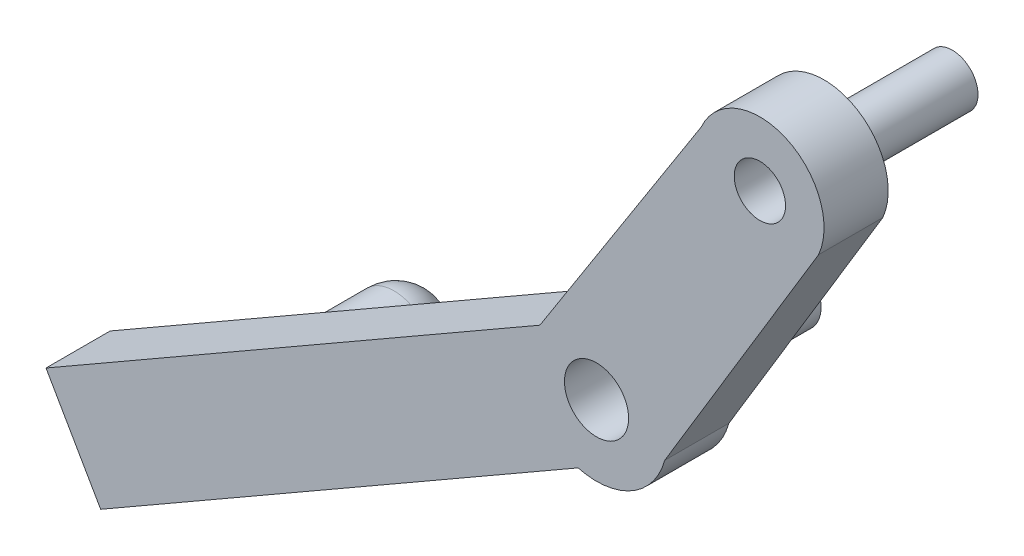
ISO-10303-21;
HEADER;
FILE_DESCRIPTION(('STEP AP214'),'2;1');
FILE_NAME('part.step','',(''),(''),'','','');
FILE_SCHEMA(('AUTOMOTIVE_DESIGN { 1 0 10303 214 1 1 1 1 }'));
ENDSEC;
DATA;
#1=APPLICATION_CONTEXT('core data for automotive mechanical design processes');
#2=APPLICATION_PROTOCOL_DEFINITION('international standard','automotive_design',2000,#1);
#3=PRODUCT_CONTEXT('',#1,'mechanical');
#4=PRODUCT('Part','Part','',(#3));
#5=PRODUCT_RELATED_PRODUCT_CATEGORY('part','',(#4));
#6=PRODUCT_DEFINITION_FORMATION('','',#4);
#7=PRODUCT_DEFINITION_CONTEXT('part definition',#1,'design');
#8=PRODUCT_DEFINITION('design','',#6,#7);
#9=PRODUCT_DEFINITION_SHAPE('','',#8);
#10=(LENGTH_UNIT() NAMED_UNIT(*) SI_UNIT(.MILLI.,.METRE.));
#11=(NAMED_UNIT(*) PLANE_ANGLE_UNIT() SI_UNIT($,.RADIAN.));
#12=(NAMED_UNIT(*) SI_UNIT($,.STERADIAN.) SOLID_ANGLE_UNIT());
#13=UNCERTAINTY_MEASURE_WITH_UNIT(LENGTH_MEASURE(1.E-05),#10,'distance_accuracy_value','');
#14=(GEOMETRIC_REPRESENTATION_CONTEXT(3) GLOBAL_UNCERTAINTY_ASSIGNED_CONTEXT((#13)) GLOBAL_UNIT_ASSIGNED_CONTEXT((#10,
#11,#12)) REPRESENTATION_CONTEXT('',''));
#15=CARTESIAN_POINT('',(0.,0.,0.));
#16=DIRECTION('',(0.,0.,1.));
#17=DIRECTION('',(1.,0.,0.));
#18=AXIS2_PLACEMENT_3D('',#15,#16,#17);
#19=CARTESIAN_POINT('',(2.48034743292827,-4.35301832543163,-15.));
#20=DIRECTION('',(0.,0.,1.));
#21=DIRECTION('',(-1.,0.,0.));
#22=AXIS2_PLACEMENT_3D('',#19,#20,#21);
#23=CYLINDRICAL_SURFACE('',#22,2.5);
#24=CARTESIAN_POINT('',(2.48034743292827,-4.35301832543163,-15.));
#25=DIRECTION('',(0.,0.,1.));
#26=DIRECTION('',(1.,0.,0.));
#27=AXIS2_PLACEMENT_3D('',#24,#25,#26);
#28=CIRCLE('',#27,2.5);
#29=CARTESIAN_POINT('',(4.98034743292827,-4.35301832543163,-15.));
#30=VERTEX_POINT('',#29);
#31=EDGE_CURVE('E11',#30,#30,#28,.T.);
#32=ORIENTED_EDGE('',*,*,#31,.T.);
#33=EDGE_LOOP('',(#32));
#34=FACE_BOUND('',#33,.T.);
#35=CARTESIAN_POINT('',(2.48034743292827,-4.35301832543163,-5.));
#36=DIRECTION('',(0.,0.,1.));
#37=DIRECTION('',(1.,0.,0.));
#38=AXIS2_PLACEMENT_3D('',#35,#36,#37);
#39=CIRCLE('',#38,2.5);
#40=CARTESIAN_POINT('',(4.98034743292827,-4.35301832543163,-5.));
#41=VERTEX_POINT('',#40);
#42=EDGE_CURVE('E49',#41,#41,#39,.T.);
#43=ORIENTED_EDGE('',*,*,#42,.F.);
#44=EDGE_LOOP('',(#43));
#45=FACE_BOUND('',#44,.T.);
#46=ADVANCED_FACE('F46',(#34,#45),#23,.T.);
#47=CARTESIAN_POINT('',(2.48034743292827,-4.35301832543163,-15.));
#48=DIRECTION('',(0.,0.,-1.));
#49=DIRECTION('',(1.,0.,0.));
#50=AXIS2_PLACEMENT_3D('',#47,#48,#49);
#51=PLANE('',#50);
#52=ORIENTED_EDGE('',*,*,#31,.F.);
#53=EDGE_LOOP('',(#52));
#54=FACE_BOUND('',#53,.T.);
#55=ADVANCED_FACE('F61',(#54),#51,.T.);
#56=CARTESIAN_POINT('',(2.48034743292827,-4.35301832543163,-5.));
#57=DIRECTION('',(0.,0.,-1.));
#58=DIRECTION('',(1.,0.,0.));
#59=AXIS2_PLACEMENT_3D('',#56,#57,#58);
#60=PLANE('',#59);
#61=ORIENTED_EDGE('',*,*,#42,.T.);
#62=EDGE_LOOP('',(#61));
#63=FACE_BOUND('',#62,.T.);
#64=ADVANCED_FACE('F58',(#63),#60,.F.);
#65=CLOSED_SHELL('',(#46,#55,#64));
#66=MANIFOLD_SOLID_BREP('B2',#65);
#67=CARTESIAN_POINT('',(15.2131519884464,16.1187767320402,-15.));
#68=DIRECTION('',(0.,0.,1.));
#69=DIRECTION('',(-1.,0.,0.));
#70=AXIS2_PLACEMENT_3D('',#67,#68,#69);
#71=CYLINDRICAL_SURFACE('',#70,2.);
#72=CARTESIAN_POINT('',(15.2131519884464,16.1187767320402,-15.));
#73=DIRECTION('',(0.,0.,1.));
#74=DIRECTION('',(1.,0.,0.));
#75=AXIS2_PLACEMENT_3D('',#72,#73,#74);
#76=CIRCLE('',#75,2.);
#77=CARTESIAN_POINT('',(17.2131519884464,16.1187767320402,-15.));
#78=VERTEX_POINT('',#77);
#79=EDGE_CURVE('E45',#78,#78,#76,.T.);
#80=ORIENTED_EDGE('',*,*,#79,.T.);
#81=EDGE_LOOP('',(#80));
#82=FACE_BOUND('',#81,.T.);
#83=CARTESIAN_POINT('',(15.2131519884464,16.1187767320402,-5.));
#84=DIRECTION('',(0.,0.,1.));
#85=DIRECTION('',(1.,0.,0.));
#86=AXIS2_PLACEMENT_3D('',#83,#84,#85);
#87=CIRCLE('',#86,2.);
#88=CARTESIAN_POINT('',(17.2131519884464,16.1187767320402,-5.));
#89=VERTEX_POINT('',#88);
#90=EDGE_CURVE('E99',#89,#89,#87,.T.);
#91=ORIENTED_EDGE('',*,*,#90,.F.);
#92=EDGE_LOOP('',(#91));
#93=FACE_BOUND('',#92,.T.);
#94=ADVANCED_FACE('F96',(#82,#93),#71,.T.);
#95=CARTESIAN_POINT('',(15.2131519884464,16.1187767320402,-15.));
#96=DIRECTION('',(0.,0.,-1.));
#97=DIRECTION('',(1.,0.,0.));
#98=AXIS2_PLACEMENT_3D('',#95,#96,#97);
#99=PLANE('',#98);
#100=ORIENTED_EDGE('',*,*,#79,.F.);
#101=EDGE_LOOP('',(#100));
#102=FACE_BOUND('',#101,.T.);
#103=ADVANCED_FACE('F111',(#102),#99,.T.);
#104=CARTESIAN_POINT('',(15.2131519884464,16.1187767320402,-5.));
#105=DIRECTION('',(0.,0.,-1.));
#106=DIRECTION('',(1.,0.,0.));
#107=AXIS2_PLACEMENT_3D('',#104,#105,#106);
#108=PLANE('',#107);
#109=ORIENTED_EDGE('',*,*,#90,.T.);
#110=EDGE_LOOP('',(#109));
#111=FACE_BOUND('',#110,.T.);
#112=ADVANCED_FACE('F108',(#111),#108,.F.);
#113=CLOSED_SHELL('',(#94,#103,#112));
#114=MANIFOLD_SOLID_BREP('B6',#113);
#115=CARTESIAN_POINT('',(-25.2931810081454,-19.8826359089883,-15.));
#116=DIRECTION('',(0.,0.,1.));
#117=DIRECTION('',(-1.,0.,0.));
#118=AXIS2_PLACEMENT_3D('',#115,#116,#117);
#119=CYLINDRICAL_SURFACE('',#118,3.);
#120=CARTESIAN_POINT('',(-25.2931810081454,-19.8826359089883,-5.));
#121=DIRECTION('',(0.,0.,1.));
#122=DIRECTION('',(1.,0.,0.));
#123=AXIS2_PLACEMENT_3D('',#120,#121,#122);
#124=CIRCLE('',#123,3.);
#125=CARTESIAN_POINT('',(-22.2931810081454,-19.8826359089883,-5.));
#126=VERTEX_POINT('',#125);
#127=EDGE_CURVE('E239',#126,#126,#124,.T.);
#128=ORIENTED_EDGE('',*,*,#127,.F.);
#129=EDGE_LOOP('',(#128));
#130=FACE_BOUND('',#129,.T.);
#131=CARTESIAN_POINT('',(-25.2931810081454,-19.8826359089884,-12.));
#132=DIRECTION('',(0.,0.,1.));
#133=DIRECTION('',(1.,0.,0.));
#134=AXIS2_PLACEMENT_3D('',#131,#132,#133);
#135=CIRCLE('',#134,3.);
#136=CARTESIAN_POINT('',(-22.2931810081454,-19.8826359089884,-12.));
#137=VERTEX_POINT('',#136);
#138=EDGE_CURVE('E416',#137,#137,#135,.T.);
#139=ORIENTED_EDGE('',*,*,#138,.T.);
#140=EDGE_LOOP('',(#139));
#141=FACE_BOUND('',#140,.T.);
#142=ADVANCED_FACE('F137',(#130,#141),#119,.T.);
#143=CARTESIAN_POINT('',(-0.682703439514869,0.436635830889686,-5.));
#144=DIRECTION('',(-0.842436284988127,0.538795977838925,0.));
#145=DIRECTION('',(-0.538795977838925,-0.842436284988127,0.));
#146=AXIS2_PLACEMENT_3D('',#143,#144,#145);
#147=PLANE('',#146);
#148=DIRECTION('',(0.538795977838925,0.842436284988127,0.));
#149=VECTOR('',#148,1.);
#150=CARTESIAN_POINT('',(-0.682703439514869,0.436635830889686,0.));
#151=LINE('',#150,#149);
#152=CARTESIAN_POINT('',(-1.93424021867878,-1.52020875988425,0.));
#153=VERTEX_POINT('',#152);
#154=CARTESIAN_POINT('',(10.6400793801503,18.1404114466345,0.));
#155=VERTEX_POINT('',#154);
#156=EDGE_CURVE('E235',#153,#155,#151,.T.);
#157=ORIENTED_EDGE('',*,*,#156,.T.);
#158=DIRECTION('',(0.,0.,1.));
#159=VECTOR('',#158,1.);
#160=CARTESIAN_POINT('',(10.6400793801503,18.1404114466345,-5.));
#161=LINE('',#160,#159);
#162=CARTESIAN_POINT('',(10.6400793801503,18.1404114466345,-5.));
#163=VERTEX_POINT('',#162);
#164=EDGE_CURVE('E234',#163,#155,#161,.T.);
#165=ORIENTED_EDGE('',*,*,#164,.F.);
#166=DIRECTION('',(0.538795977838925,0.842436284988127,0.));
#167=VECTOR('',#166,1.);
#168=CARTESIAN_POINT('',(-0.682703439514869,0.436635830889686,-5.));
#169=LINE('',#168,#167);
#170=CARTESIAN_POINT('',(-1.93424021867878,-1.52020875988425,-5.));
#171=VERTEX_POINT('',#170);
#172=EDGE_CURVE('E257',#171,#163,#169,.T.);
#173=ORIENTED_EDGE('',*,*,#172,.F.);
#174=DIRECTION('',(0.,0.,1.));
#175=VECTOR('',#174,1.);
#176=CARTESIAN_POINT('',(-1.93424021867878,-1.52020875988425,-5.));
#177=LINE('',#176,#175);
#178=EDGE_CURVE('E94',#171,#153,#177,.T.);
#179=ORIENTED_EDGE('',*,*,#178,.T.);
#180=EDGE_LOOP('',(#157,#165,#173,#179));
#181=FACE_BOUND('',#180,.T.);
#182=ADVANCED_FACE('F139',(#181),#147,.T.);
#183=CARTESIAN_POINT('',(0.17625658415401,-0.30648591573246,-5.));
#184=DIRECTION('',(-0.498528903536302,0.866873077410351,0.));
#185=DIRECTION('',(-0.866873077410351,-0.498528903536302,0.));
#186=AXIS2_PLACEMENT_3D('',#183,#184,#185);
#187=PLANE('',#186);
#188=DIRECTION('',(0.866873077410351,0.498528903536302,0.));
#189=VECTOR('',#188,1.);
#190=CARTESIAN_POINT('',(0.17625658415401,-0.30648591573246,0.));
#191=LINE('',#190,#189);
#192=CARTESIAN_POINT('',(-40.4263847840177,-23.6566057999731,0.));
#193=VERTEX_POINT('',#192);
#194=EDGE_CURVE('E238',#193,#153,#191,.T.);
#195=ORIENTED_EDGE('',*,*,#194,.T.);
#196=ORIENTED_EDGE('',*,*,#178,.F.);
#197=DIRECTION('',(0.866873077410351,0.498528903536302,0.));
#198=VECTOR('',#197,1.);
#199=CARTESIAN_POINT('',(0.17625658415401,-0.30648591573246,-5.));
#200=LINE('',#199,#198);
#201=CARTESIAN_POINT('',(-40.4263847840177,-23.6566057999731,-5.));
#202=VERTEX_POINT('',#201);
#203=EDGE_CURVE('E189',#202,#171,#200,.T.);
#204=ORIENTED_EDGE('',*,*,#203,.F.);
#205=DIRECTION('',(0.,0.,1.));
#206=VECTOR('',#205,1.);
#207=CARTESIAN_POINT('',(-40.4263847840177,-23.6566057999731,-5.));
#208=LINE('',#207,#206);
#209=EDGE_CURVE('E146',#202,#193,#208,.T.);
#210=ORIENTED_EDGE('',*,*,#209,.T.);
#211=EDGE_LOOP('',(#195,#196,#204,#210));
#212=FACE_BOUND('',#211,.T.);
#213=ADVANCED_FACE('F267',(#212),#187,.T.);
#214=CARTESIAN_POINT('',(-40.6026413681717,-23.3501198842406,-5.));
#215=DIRECTION('',(0.866873077410351,0.498528903536302,0.));
#216=DIRECTION('',(-0.498528903536302,0.866873077410351,0.));
#217=AXIS2_PLACEMENT_3D('',#214,#215,#216);
#218=PLANE('',#217);
#219=DIRECTION('',(0.498528903536302,-0.866873077410351,0.));
#220=VECTOR('',#219,1.);
#221=CARTESIAN_POINT('',(-40.6026413681717,-23.3501198842406,0.));
#222=LINE('',#221,#220);
#223=CARTESIAN_POINT('',(-36.1661695545836,-31.0645331240926,0.));
#224=VERTEX_POINT('',#223);
#225=EDGE_CURVE('E241',#193,#224,#222,.T.);
#226=ORIENTED_EDGE('',*,*,#225,.F.);
#227=ORIENTED_EDGE('',*,*,#209,.F.);
#228=DIRECTION('',(0.498528903536302,-0.866873077410351,0.));
#229=VECTOR('',#228,1.);
#230=CARTESIAN_POINT('',(-40.6026413681717,-23.3501198842406,-5.));
#231=LINE('',#230,#229);
#232=CARTESIAN_POINT('',(-36.1661695545836,-31.0645331240926,-5.));
#233=VERTEX_POINT('',#232);
#234=EDGE_CURVE('E223',#202,#233,#231,.T.);
#235=ORIENTED_EDGE('',*,*,#234,.T.);
#236=DIRECTION('',(0.,0.,1.));
#237=VECTOR('',#236,1.);
#238=CARTESIAN_POINT('',(-36.1661695545836,-31.0645331240926,-5.));
#239=LINE('',#238,#237);
#240=EDGE_CURVE('E261',#233,#224,#239,.T.);
#241=ORIENTED_EDGE('',*,*,#240,.T.);
#242=EDGE_LOOP('',(#226,#227,#235,#241));
#243=FACE_BOUND('',#242,.T.);
#244=ADVANCED_FACE('F279',(#243),#218,.F.);
#245=CARTESIAN_POINT('',(4.43647181358803,-7.71441323985198,-5.));
#246=DIRECTION('',(-0.498528903536302,0.866873077410351,0.));
#247=DIRECTION('',(-0.866873077410351,-0.498528903536302,0.));
#248=AXIS2_PLACEMENT_3D('',#245,#246,#247);
#249=PLANE('',#248);
#250=DIRECTION('',(0.866873077410351,0.498528903536302,0.));
#251=VECTOR('',#250,1.);
#252=CARTESIAN_POINT('',(4.43647181358803,-7.71441323985198,0.));
#253=LINE('',#252,#251);
#254=CARTESIAN_POINT('',(1.04782478556533,-9.66318582418271,0.));
#255=VERTEX_POINT('',#254);
#256=EDGE_CURVE('E244',#224,#255,#253,.T.);
#257=ORIENTED_EDGE('',*,*,#256,.F.);
#258=ORIENTED_EDGE('',*,*,#240,.F.);
#259=DIRECTION('',(0.866873077410351,0.498528903536302,0.));
#260=VECTOR('',#259,1.);
#261=CARTESIAN_POINT('',(4.43647181358803,-7.71441323985198,-5.));
#262=LINE('',#261,#260);
#263=CARTESIAN_POINT('',(1.04782478556533,-9.66318582418271,-5.));
#264=VERTEX_POINT('',#263);
#265=EDGE_CURVE('E221',#233,#264,#262,.T.);
#266=ORIENTED_EDGE('',*,*,#265,.T.);
#267=DIRECTION('',(0.,0.,1.));
#268=VECTOR('',#267,1.);
#269=CARTESIAN_POINT('',(1.04782478556533,-9.66318582418271,-5.));
#270=LINE('',#269,#268);
#271=EDGE_CURVE('E215',#264,#255,#270,.T.);
#272=ORIENTED_EDGE('',*,*,#271,.T.);
#273=EDGE_LOOP('',(#257,#258,#266,#272));
#274=FACE_BOUND('',#273,.T.);
#275=ADVANCED_FACE('F282',(#274),#249,.F.);
#276=CARTESIAN_POINT('',(2.48034743292827,-4.35301832543163,-5.));
#277=DIRECTION('',(0.,0.,1.));
#278=DIRECTION('',(-1.,0.,0.));
#279=AXIS2_PLACEMENT_3D('',#276,#277,#278);
#280=CYLINDRICAL_SURFACE('',#279,5.5);
#281=CARTESIAN_POINT('',(2.48034743292827,-4.35301832543163,0.));
#282=DIRECTION('',(0.,0.,1.));
#283=DIRECTION('',(1.,0.,0.));
#284=AXIS2_PLACEMENT_3D('',#281,#282,#283);
#285=CIRCLE('',#284,5.5);
#286=CARTESIAN_POINT('',(7.79051493167935,-5.78554097279456,0.));
#287=VERTEX_POINT('',#286);
#288=EDGE_CURVE('E247',#255,#287,#285,.T.);
#289=ORIENTED_EDGE('',*,*,#288,.F.);
#290=ORIENTED_EDGE('',*,*,#271,.F.);
#291=CARTESIAN_POINT('',(2.48034743292827,-4.35301832543163,-5.));
#292=DIRECTION('',(0.,0.,1.));
#293=DIRECTION('',(1.,0.,0.));
#294=AXIS2_PLACEMENT_3D('',#291,#292,#293);
#295=CIRCLE('',#294,5.5);
#296=CARTESIAN_POINT('',(7.79051493167935,-5.78554097279456,-5.));
#297=VERTEX_POINT('',#296);
#298=EDGE_CURVE('E205',#264,#297,#295,.T.);
#299=ORIENTED_EDGE('',*,*,#298,.T.);
#300=DIRECTION('',(0.,0.,1.));
#301=VECTOR('',#300,1.);
#302=CARTESIAN_POINT('',(7.79051493167935,-5.78554097279456,-5.));
#303=LINE('',#302,#301);
#304=EDGE_CURVE('E210',#297,#287,#303,.T.);
#305=ORIENTED_EDGE('',*,*,#304,.T.);
#306=EDGE_LOOP('',(#289,#290,#299,#305));
#307=FACE_BOUND('',#306,.T.);
#308=ADVANCED_FACE('F218',(#307),#280,.T.);
#309=CARTESIAN_POINT('',(8.27057905312399,-4.98984292672802,-5.));
#310=DIRECTION('',(-0.856234541670631,0.51658727205583,0.));
#311=DIRECTION('',(-0.51658727205583,-0.856234541670632,0.));
#312=AXIS2_PLACEMENT_3D('',#309,#310,#311);
#313=PLANE('',#312);
#314=DIRECTION('',(0.51658727205583,0.856234541670631,0.));
#315=VECTOR('',#314,1.);
#316=CARTESIAN_POINT('',(8.27057905312399,-4.98984292672802,0.));
#317=LINE('',#316,#315);
#318=CARTESIAN_POINT('',(19.7862245967424,14.097142017446,0.));
#319=VERTEX_POINT('',#318);
#320=EDGE_CURVE('E212',#287,#319,#317,.T.);
#321=ORIENTED_EDGE('',*,*,#320,.F.);
#322=ORIENTED_EDGE('',*,*,#304,.F.);
#323=DIRECTION('',(0.51658727205583,0.856234541670631,0.));
#324=VECTOR('',#323,1.);
#325=CARTESIAN_POINT('',(8.27057905312399,-4.98984292672802,-5.));
#326=LINE('',#325,#324);
#327=CARTESIAN_POINT('',(19.7862245967424,14.097142017446,-5.));
#328=VERTEX_POINT('',#327);
#329=EDGE_CURVE('E200',#297,#328,#326,.T.);
#330=ORIENTED_EDGE('',*,*,#329,.T.);
#331=DIRECTION('',(0.,0.,1.));
#332=VECTOR('',#331,1.);
#333=CARTESIAN_POINT('',(19.7862245967424,14.097142017446,-5.));
#334=LINE('',#333,#332);
#335=EDGE_CURVE('E216',#328,#319,#334,.T.);
#336=ORIENTED_EDGE('',*,*,#335,.T.);
#337=EDGE_LOOP('',(#321,#322,#330,#336));
#338=FACE_BOUND('',#337,.T.);
#339=ADVANCED_FACE('F211',(#338),#313,.F.);
#340=CARTESIAN_POINT('',(15.2131519884464,16.1187767320402,-5.));
#341=DIRECTION('',(0.,0.,1.));
#342=DIRECTION('',(-1.,0.,0.));
#343=AXIS2_PLACEMENT_3D('',#340,#341,#342);
#344=CYLINDRICAL_SURFACE('',#343,2.);
#345=CARTESIAN_POINT('',(15.2131519884464,16.1187767320402,-5.));
#346=DIRECTION('',(0.,0.,1.));
#347=DIRECTION('',(1.,0.,0.));
#348=AXIS2_PLACEMENT_3D('',#345,#346,#347);
#349=CIRCLE('',#348,2.);
#350=CARTESIAN_POINT('',(17.2131519884464,16.1187767320402,-5.));
#351=VERTEX_POINT('',#350);
#352=EDGE_CURVE('E228',#351,#351,#349,.T.);
#353=ORIENTED_EDGE('',*,*,#352,.F.);
#354=EDGE_LOOP('',(#353));
#355=FACE_BOUND('',#354,.T.);
#356=CARTESIAN_POINT('',(15.2131519884464,16.1187767320402,0.));
#357=DIRECTION('',(0.,0.,1.));
#358=DIRECTION('',(1.,0.,0.));
#359=AXIS2_PLACEMENT_3D('',#356,#357,#358);
#360=CIRCLE('',#359,2.);
#361=CARTESIAN_POINT('',(17.2131519884464,16.1187767320402,0.));
#362=VERTEX_POINT('',#361);
#363=EDGE_CURVE('E251',#362,#362,#360,.T.);
#364=ORIENTED_EDGE('',*,*,#363,.T.);
#365=EDGE_LOOP('',(#364));
#366=FACE_BOUND('',#365,.T.);
#367=ADVANCED_FACE('F314',(#355,#366),#344,.F.);
#368=CARTESIAN_POINT('',(15.2131519884464,16.1187767320402,-5.));
#369=DIRECTION('',(0.,0.,1.));
#370=DIRECTION('',(-1.,0.,0.));
#371=AXIS2_PLACEMENT_3D('',#368,#369,#370);
#372=CYLINDRICAL_SURFACE('',#371,5.);
#373=CARTESIAN_POINT('',(15.2131519884464,16.1187767320402,0.));
#374=DIRECTION('',(0.,0.,1.));
#375=DIRECTION('',(1.,0.,0.));
#376=AXIS2_PLACEMENT_3D('',#373,#374,#375);
#377=CIRCLE('',#376,5.);
#378=EDGE_CURVE('E177',#319,#155,#377,.T.);
#379=ORIENTED_EDGE('',*,*,#378,.F.);
#380=ORIENTED_EDGE('',*,*,#335,.F.);
#381=CARTESIAN_POINT('',(15.2131519884464,16.1187767320402,-5.));
#382=DIRECTION('',(0.,0.,1.));
#383=DIRECTION('',(1.,0.,0.));
#384=AXIS2_PLACEMENT_3D('',#381,#382,#383);
#385=CIRCLE('',#384,5.);
#386=EDGE_CURVE('E154',#328,#163,#385,.T.);
#387=ORIENTED_EDGE('',*,*,#386,.T.);
#388=ORIENTED_EDGE('',*,*,#164,.T.);
#389=EDGE_LOOP('',(#379,#380,#387,#388));
#390=FACE_BOUND('',#389,.T.);
#391=ADVANCED_FACE('F312',(#390),#372,.T.);
#392=CARTESIAN_POINT('',(2.48034743292827,-4.35301832543163,-5.));
#393=DIRECTION('',(0.,0.,1.));
#394=DIRECTION('',(-1.,0.,0.));
#395=AXIS2_PLACEMENT_3D('',#392,#393,#394);
#396=CYLINDRICAL_SURFACE('',#395,2.5);
#397=CARTESIAN_POINT('',(2.48034743292827,-4.35301832543163,-5.));
#398=DIRECTION('',(0.,0.,1.));
#399=DIRECTION('',(1.,0.,0.));
#400=AXIS2_PLACEMENT_3D('',#397,#398,#399);
#401=CIRCLE('',#400,2.5);
#402=CARTESIAN_POINT('',(4.98034743292827,-4.35301832543163,-5.));
#403=VERTEX_POINT('',#402);
#404=EDGE_CURVE('E231',#403,#403,#401,.T.);
#405=ORIENTED_EDGE('',*,*,#404,.F.);
#406=EDGE_LOOP('',(#405));
#407=FACE_BOUND('',#406,.T.);
#408=CARTESIAN_POINT('',(2.48034743292827,-4.35301832543163,0.));
#409=DIRECTION('',(0.,0.,1.));
#410=DIRECTION('',(1.,0.,0.));
#411=AXIS2_PLACEMENT_3D('',#408,#409,#410);
#412=CIRCLE('',#411,2.5);
#413=CARTESIAN_POINT('',(4.98034743292827,-4.35301832543163,0.));
#414=VERTEX_POINT('',#413);
#415=EDGE_CURVE('E254',#414,#414,#412,.T.);
#416=ORIENTED_EDGE('',*,*,#415,.T.);
#417=EDGE_LOOP('',(#416));
#418=FACE_BOUND('',#417,.T.);
#419=ADVANCED_FACE('F305',(#407,#418),#396,.F.);
#420=CARTESIAN_POINT('',(0.,0.,-5.));
#421=DIRECTION('',(0.,0.,-1.));
#422=DIRECTION('',(1.,0.,0.));
#423=AXIS2_PLACEMENT_3D('',#420,#421,#422);
#424=PLANE('',#423);
#425=ORIENTED_EDGE('',*,*,#127,.T.);
#426=EDGE_LOOP('',(#425));
#427=FACE_BOUND('',#426,.T.);
#428=ORIENTED_EDGE('',*,*,#172,.T.);
#429=ORIENTED_EDGE('',*,*,#386,.F.);
#430=ORIENTED_EDGE('',*,*,#329,.F.);
#431=ORIENTED_EDGE('',*,*,#298,.F.);
#432=ORIENTED_EDGE('',*,*,#265,.F.);
#433=ORIENTED_EDGE('',*,*,#234,.F.);
#434=ORIENTED_EDGE('',*,*,#203,.T.);
#435=EDGE_LOOP('',(#428,#429,#430,#431,#432,#433,#434));
#436=FACE_BOUND('',#435,.T.);
#437=ORIENTED_EDGE('',*,*,#352,.T.);
#438=EDGE_LOOP('',(#437));
#439=FACE_BOUND('',#438,.T.);
#440=ORIENTED_EDGE('',*,*,#404,.T.);
#441=EDGE_LOOP('',(#440));
#442=FACE_BOUND('',#441,.T.);
#443=ADVANCED_FACE('F202',(#427,#436,#439,#442),#424,.T.);
#444=CARTESIAN_POINT('',(0.,0.,0.));
#445=DIRECTION('',(0.,0.,-1.));
#446=DIRECTION('',(1.,0.,0.));
#447=AXIS2_PLACEMENT_3D('',#444,#445,#446);
#448=PLANE('',#447);
#449=ORIENTED_EDGE('',*,*,#156,.F.);
#450=ORIENTED_EDGE('',*,*,#194,.F.);
#451=ORIENTED_EDGE('',*,*,#225,.T.);
#452=ORIENTED_EDGE('',*,*,#256,.T.);
#453=ORIENTED_EDGE('',*,*,#288,.T.);
#454=ORIENTED_EDGE('',*,*,#320,.T.);
#455=ORIENTED_EDGE('',*,*,#378,.T.);
#456=EDGE_LOOP('',(#449,#450,#451,#452,#453,#454,#455));
#457=FACE_BOUND('',#456,.T.);
#458=ORIENTED_EDGE('',*,*,#363,.F.);
#459=EDGE_LOOP('',(#458));
#460=FACE_BOUND('',#459,.T.);
#461=ORIENTED_EDGE('',*,*,#415,.F.);
#462=EDGE_LOOP('',(#461));
#463=FACE_BOUND('',#462,.T.);
#464=ADVANCED_FACE('F270',(#457,#460,#463),#448,.F.);
#465=CARTESIAN_POINT('',(-25.2931810081454,-19.8826359089884,-12.));
#466=DIRECTION('',(0.,0.,-1.));
#467=DIRECTION('',(1.,0.,0.));
#468=AXIS2_PLACEMENT_3D('',#465,#466,#467);
#469=DEGENERATE_TOROIDAL_SURFACE('',#468,0.250000000000002,3.25,.F.);
#470=ORIENTED_EDGE('',*,*,#138,.F.);
#471=EDGE_LOOP('',(#470));
#472=FACE_BOUND('',#471,.T.);
#473=CARTESIAN_POINT('',(-25.2931810081454,-19.8826359089884,-15.));
#474=DIRECTION('',(0.,0.,1.));
#475=DIRECTION('',(1.,0.,0.));
#476=AXIS2_PLACEMENT_3D('',#473,#474,#475);
#477=CIRCLE('',#476,0.999999999999999);
#478=CARTESIAN_POINT('',(-24.2931810081454,-19.8826359089884,-15.));
#479=VERTEX_POINT('',#478);
#480=EDGE_CURVE('E414',#479,#479,#477,.T.);
#481=ORIENTED_EDGE('',*,*,#480,.T.);
#482=EDGE_LOOP('',(#481));
#483=FACE_BOUND('',#482,.T.);
#484=ADVANCED_FACE('F309',(#472,#483),#469,.F.);
#485=CARTESIAN_POINT('',(-25.2931810081454,-19.8826359089883,-15.));
#486=DIRECTION('',(0.,0.,-1.));
#487=DIRECTION('',(1.,0.,0.));
#488=AXIS2_PLACEMENT_3D('',#485,#486,#487);
#489=PLANE('',#488);
#490=ORIENTED_EDGE('',*,*,#480,.F.);
#491=EDGE_LOOP('',(#490));
#492=FACE_BOUND('',#491,.T.);
#493=ADVANCED_FACE('F301',(#492),#489,.T.);
#494=CLOSED_SHELL('',(#142,#182,#213,#244,#275,#308,#339,#367,#391,#419,#443,#464,#484,#493));
#495=MANIFOLD_SOLID_BREP('B40',#494);
#496=ADVANCED_BREP_SHAPE_REPRESENTATION('',(#18,#66,#114,#495),#14);
#497=SHAPE_DEFINITION_REPRESENTATION(#9,#496);
ENDSEC;
END-ISO-10303-21;
